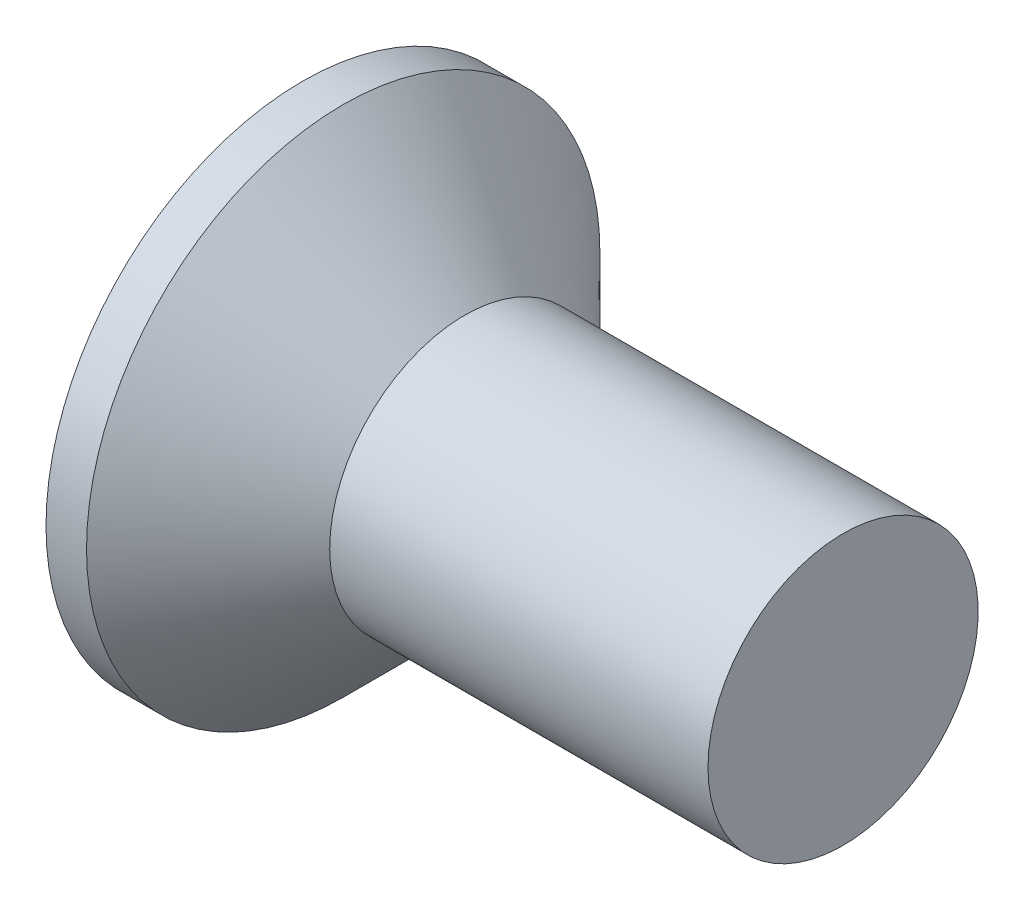
ISO-10303-21;
HEADER;
FILE_DESCRIPTION(('STEP AP214'),'2;1');
FILE_NAME('part.step','',(''),(''),'','','');
FILE_SCHEMA(('AUTOMOTIVE_DESIGN { 1 0 10303 214 1 1 1 1 }'));
ENDSEC;
DATA;
#1=APPLICATION_CONTEXT('core data for automotive mechanical design processes');
#2=APPLICATION_PROTOCOL_DEFINITION('international standard','automotive_design',2000,#1);
#3=PRODUCT_CONTEXT('',#1,'mechanical');
#4=PRODUCT('Part','Part','',(#3));
#5=PRODUCT_RELATED_PRODUCT_CATEGORY('part','',(#4));
#6=PRODUCT_DEFINITION_FORMATION('','',#4);
#7=PRODUCT_DEFINITION_CONTEXT('part definition',#1,'design');
#8=PRODUCT_DEFINITION('design','',#6,#7);
#9=PRODUCT_DEFINITION_SHAPE('','',#8);
#10=(LENGTH_UNIT() NAMED_UNIT(*) SI_UNIT(.MILLI.,.METRE.));
#11=(NAMED_UNIT(*) PLANE_ANGLE_UNIT() SI_UNIT($,.RADIAN.));
#12=(NAMED_UNIT(*) SI_UNIT($,.STERADIAN.) SOLID_ANGLE_UNIT());
#13=UNCERTAINTY_MEASURE_WITH_UNIT(LENGTH_MEASURE(1.E-05),#10,'distance_accuracy_value','');
#14=(GEOMETRIC_REPRESENTATION_CONTEXT(3) GLOBAL_UNCERTAINTY_ASSIGNED_CONTEXT((#13)) GLOBAL_UNIT_ASSIGNED_CONTEXT((#10,
#11,#12)) REPRESENTATION_CONTEXT('',''));
#15=CARTESIAN_POINT('',(0.,0.,0.));
#16=DIRECTION('',(0.,0.,1.));
#17=DIRECTION('',(1.,0.,0.));
#18=AXIS2_PLACEMENT_3D('',#15,#16,#17);
#19=CARTESIAN_POINT('',(0.,0.,0.));
#20=DIRECTION('',(-1.,0.,0.));
#21=DIRECTION('',(0.,0.,1.));
#22=AXIS2_PLACEMENT_3D('',#19,#20,#21);
#23=PLANE('',#22);
#24=CARTESIAN_POINT('',(0.,0.,0.));
#25=DIRECTION('',(-1.,0.,0.));
#26=DIRECTION('',(0.,0.,1.));
#27=AXIS2_PLACEMENT_3D('',#24,#25,#26);
#28=CIRCLE('',#27,1.9);
#29=CARTESIAN_POINT('',(0.,0.,1.9));
#30=VERTEX_POINT('',#29);
#31=EDGE_CURVE('E42',#30,#30,#28,.T.);
#32=ORIENTED_EDGE('',*,*,#31,.T.);
#33=EDGE_LOOP('',(#32));
#34=FACE_BOUND('',#33,.T.);
#35=DIRECTION('',(0.,1.,0.));
#36=VECTOR('',#35,1.);
#37=CARTESIAN_POINT('',(0.,-1.07,-0.264999999999999));
#38=LINE('',#37,#36);
#39=CARTESIAN_POINT('',(0.,-1.07,-0.264999999999999));
#40=VERTEX_POINT('',#39);
#41=CARTESIAN_POINT('',(0.,-0.264999999999999,-0.265));
#42=VERTEX_POINT('',#41);
#43=EDGE_CURVE('E103',#40,#42,#38,.T.);
#44=ORIENTED_EDGE('',*,*,#43,.T.);
#45=DIRECTION('',(0.,0.,-1.));
#46=VECTOR('',#45,1.);
#47=CARTESIAN_POINT('',(0.,-0.265000000000004,1.07));
#48=LINE('',#47,#46);
#49=CARTESIAN_POINT('',(0.,-0.264999999999996,-1.07));
#50=VERTEX_POINT('',#49);
#51=EDGE_CURVE('E83',#42,#50,#48,.T.);
#52=ORIENTED_EDGE('',*,*,#51,.T.);
#53=DIRECTION('',(0.,1.,0.));
#54=VECTOR('',#53,1.);
#55=CARTESIAN_POINT('',(0.,-0.264999999999996,-1.07));
#56=LINE('',#55,#54);
#57=CARTESIAN_POINT('',(0.,0.265000000000003,-1.07));
#58=VERTEX_POINT('',#57);
#59=EDGE_CURVE('E340',#50,#58,#56,.T.);
#60=ORIENTED_EDGE('',*,*,#59,.T.);
#61=DIRECTION('',(0.,0.,1.));
#62=VECTOR('',#61,1.);
#63=CARTESIAN_POINT('',(0.,0.265000000000003,-1.07));
#64=LINE('',#63,#62);
#65=CARTESIAN_POINT('',(0.,0.265,-0.264999999999999));
#66=VERTEX_POINT('',#65);
#67=EDGE_CURVE('E99',#58,#66,#64,.T.);
#68=ORIENTED_EDGE('',*,*,#67,.T.);
#69=CARTESIAN_POINT('',(0.,1.07,-0.265));
#70=VERTEX_POINT('',#69);
#71=EDGE_CURVE('E93',#66,#70,#38,.T.);
#72=ORIENTED_EDGE('',*,*,#71,.T.);
#73=DIRECTION('',(0.,0.,1.));
#74=VECTOR('',#73,1.);
#75=CARTESIAN_POINT('',(0.,1.07,-0.265));
#76=LINE('',#75,#74);
#77=CARTESIAN_POINT('',(0.,1.07,0.265));
#78=VERTEX_POINT('',#77);
#79=EDGE_CURVE('E96',#70,#78,#76,.T.);
#80=ORIENTED_EDGE('',*,*,#79,.T.);
#81=DIRECTION('',(0.,-1.,0.));
#82=VECTOR('',#81,1.);
#83=CARTESIAN_POINT('',(0.,1.07,0.265));
#84=LINE('',#83,#82);
#85=CARTESIAN_POINT('',(0.,0.264999999999999,0.265));
#86=VERTEX_POINT('',#85);
#87=EDGE_CURVE('E352',#78,#86,#84,.T.);
#88=ORIENTED_EDGE('',*,*,#87,.T.);
#89=CARTESIAN_POINT('',(0.,0.264999999999996,1.07));
#90=VERTEX_POINT('',#89);
#91=EDGE_CURVE('E335',#86,#90,#64,.T.);
#92=ORIENTED_EDGE('',*,*,#91,.T.);
#93=DIRECTION('',(0.,-1.,0.));
#94=VECTOR('',#93,1.);
#95=CARTESIAN_POINT('',(0.,0.264999999999996,1.07));
#96=LINE('',#95,#94);
#97=CARTESIAN_POINT('',(0.,-0.265000000000004,1.07));
#98=VERTEX_POINT('',#97);
#99=EDGE_CURVE('E321',#90,#98,#96,.T.);
#100=ORIENTED_EDGE('',*,*,#99,.T.);
#101=CARTESIAN_POINT('',(0.,-0.265000000000001,0.265));
#102=VERTEX_POINT('',#101);
#103=EDGE_CURVE('E333',#98,#102,#48,.T.);
#104=ORIENTED_EDGE('',*,*,#103,.T.);
#105=CARTESIAN_POINT('',(0.,-1.07,0.265));
#106=VERTEX_POINT('',#105);
#107=EDGE_CURVE('E109',#102,#106,#84,.T.);
#108=ORIENTED_EDGE('',*,*,#107,.T.);
#109=DIRECTION('',(0.,0.,-1.));
#110=VECTOR('',#109,1.);
#111=CARTESIAN_POINT('',(0.,-1.07,0.265));
#112=LINE('',#111,#110);
#113=EDGE_CURVE('E132',#106,#40,#112,.T.);
#114=ORIENTED_EDGE('',*,*,#113,.T.);
#115=EDGE_LOOP('',(#44,#52,#60,#68,#72,#80,#88,#92,#100,#104,#108,#114));
#116=FACE_BOUND('',#115,.T.);
#117=ADVANCED_FACE('F35',(#34,#116),#23,.T.);
#118=CARTESIAN_POINT('',(1.75765333333333,0.,0.113773333333333));
#119=DIRECTION('',(-0.0857222578731989,0.,-0.996319072639443));
#120=DIRECTION('',(-0.996319072639444,0.,0.0857222578731989));
#121=AXIS2_PLACEMENT_3D('',#118,#119,#120);
#122=PLANE('',#121);
#123=ORIENTED_EDGE('',*,*,#107,.F.);
#124=DIRECTION('',(0.992678495991953,0.0854090264408664,-0.0854090264408661));
#125=VECTOR('',#124,1.);
#126=CARTESIAN_POINT('',(1.76729945793969,-0.112943390794151,0.11294339079415));
#127=LINE('',#126,#125);
#128=CARTESIAN_POINT('',(1.54,-0.1325,0.1325));
#129=VERTEX_POINT('',#128);
#130=EDGE_CURVE('E127',#102,#129,#127,.T.);
#131=ORIENTED_EDGE('',*,*,#130,.T.);
#132=DIRECTION('',(0.851874354386278,0.518592342361776,-0.0732943843871311));
#133=VECTOR('',#132,1.);
#134=CARTESIAN_POINT('',(0.,-1.07,0.265));
#135=LINE('',#134,#133);
#136=EDGE_CURVE('E104',#106,#129,#135,.T.);
#137=ORIENTED_EDGE('',*,*,#136,.F.);
#138=EDGE_LOOP('',(#123,#131,#137));
#139=FACE_BOUND('',#138,.T.);
#140=ADVANCED_FACE('F155',(#139),#122,.T.);
#141=DIRECTION('',(0.851874354386278,-0.518592342361776,-0.073294384387131));
#142=VECTOR('',#141,1.);
#143=CARTESIAN_POINT('',(0.,1.07,0.265));
#144=LINE('',#143,#142);
#145=CARTESIAN_POINT('',(1.54,0.1325,0.1325));
#146=VERTEX_POINT('',#145);
#147=EDGE_CURVE('E49',#78,#146,#144,.T.);
#148=ORIENTED_EDGE('',*,*,#147,.T.);
#149=DIRECTION('',(-0.992678495991953,0.0854090264408655,0.0854090264408661));
#150=VECTOR('',#149,1.);
#151=CARTESIAN_POINT('',(1.76729945793969,0.11294339079415,0.11294339079415));
#152=LINE('',#151,#150);
#153=EDGE_CURVE('E348',#146,#86,#152,.T.);
#154=ORIENTED_EDGE('',*,*,#153,.T.);
#155=ORIENTED_EDGE('',*,*,#87,.F.);
#156=EDGE_LOOP('',(#148,#154,#155));
#157=FACE_BOUND('',#156,.T.);
#158=ADVANCED_FACE('F159',(#157),#122,.T.);
#159=CARTESIAN_POINT('',(1.75765333333333,0.,-0.113773333333333));
#160=DIRECTION('',(-0.0857222578731985,0.,0.996319072639443));
#161=DIRECTION('',(0.996319072639444,0.,0.0857222578731985));
#162=AXIS2_PLACEMENT_3D('',#159,#160,#161);
#163=PLANE('',#162);
#164=DIRECTION('',(0.851874354386278,0.518592342361776,0.0732943843871307));
#165=VECTOR('',#164,1.);
#166=CARTESIAN_POINT('',(0.,-1.07,-0.264999999999999));
#167=LINE('',#166,#165);
#168=CARTESIAN_POINT('',(1.54,-0.1325,-0.1325));
#169=VERTEX_POINT('',#168);
#170=EDGE_CURVE('E58',#40,#169,#167,.T.);
#171=ORIENTED_EDGE('',*,*,#170,.T.);
#172=DIRECTION('',(-0.992678495991953,-0.0854090264408658,-0.0854090264408657));
#173=VECTOR('',#172,1.);
#174=CARTESIAN_POINT('',(1.76729945793969,-0.11294339079415,-0.112943390794151));
#175=LINE('',#174,#173);
#176=EDGE_CURVE('E11',#169,#42,#175,.T.);
#177=ORIENTED_EDGE('',*,*,#176,.T.);
#178=ORIENTED_EDGE('',*,*,#43,.F.);
#179=EDGE_LOOP('',(#171,#177,#178));
#180=FACE_BOUND('',#179,.T.);
#181=ADVANCED_FACE('F152',(#180),#163,.T.);
#182=ORIENTED_EDGE('',*,*,#71,.F.);
#183=DIRECTION('',(0.992678495991953,-0.0854090264408661,0.0854090264408658));
#184=VECTOR('',#183,1.);
#185=CARTESIAN_POINT('',(1.76729945793969,0.112943390794151,-0.112943390794151));
#186=LINE('',#185,#184);
#187=CARTESIAN_POINT('',(1.54,0.1325,-0.1325));
#188=VERTEX_POINT('',#187);
#189=EDGE_CURVE('E112',#66,#188,#186,.T.);
#190=ORIENTED_EDGE('',*,*,#189,.T.);
#191=DIRECTION('',(0.851874354386278,-0.518592342361776,0.0732943843871308));
#192=VECTOR('',#191,1.);
#193=CARTESIAN_POINT('',(0.,1.07,-0.265));
#194=LINE('',#193,#192);
#195=EDGE_CURVE('E108',#70,#188,#194,.T.);
#196=ORIENTED_EDGE('',*,*,#195,.F.);
#197=EDGE_LOOP('',(#182,#190,#196));
#198=FACE_BOUND('',#197,.T.);
#199=ADVANCED_FACE('F111',(#198),#163,.T.);
#200=CARTESIAN_POINT('',(-6.34999999999999,0.,0.));
#201=DIRECTION('',(-1.,0.,0.));
#202=DIRECTION('',(0.,0.,1.));
#203=AXIS2_PLACEMENT_3D('',#200,#201,#202);
#204=CYLINDRICAL_SURFACE('',#203,1.9);
#205=CARTESIAN_POINT('',(0.300000000000003,0.,0.));
#206=DIRECTION('',(-1.,0.,0.));
#207=DIRECTION('',(0.,0.,1.));
#208=AXIS2_PLACEMENT_3D('',#205,#206,#207);
#209=CIRCLE('',#208,1.9);
#210=CARTESIAN_POINT('',(0.300000000000003,0.,1.9));
#211=VERTEX_POINT('',#210);
#212=EDGE_CURVE('E135',#211,#211,#209,.T.);
#213=ORIENTED_EDGE('',*,*,#212,.T.);
#214=EDGE_LOOP('',(#213));
#215=FACE_BOUND('',#214,.T.);
#216=ORIENTED_EDGE('',*,*,#31,.F.);
#217=EDGE_LOOP('',(#216));
#218=FACE_BOUND('',#217,.T.);
#219=ADVANCED_FACE('F141',(#215,#218),#204,.T.);
#220=CARTESIAN_POINT('',(0.300000000000003,0.,0.));
#221=DIRECTION('',(-1.,0.,0.));
#222=DIRECTION('',(0.,0.,1.));
#223=AXIS2_PLACEMENT_3D('',#220,#221,#222);
#224=CONICAL_SURFACE('',#223,1.9,0.78539816339745);
#225=CARTESIAN_POINT('',(1.2,0.,0.));
#226=DIRECTION('',(-1.,0.,0.));
#227=DIRECTION('',(0.,0.,1.));
#228=AXIS2_PLACEMENT_3D('',#225,#226,#227);
#229=CIRCLE('',#228,1.);
#230=CARTESIAN_POINT('',(1.2,0.,1.));
#231=VERTEX_POINT('',#230);
#232=EDGE_CURVE('E131',#231,#231,#229,.T.);
#233=ORIENTED_EDGE('',*,*,#232,.T.);
#234=EDGE_LOOP('',(#233));
#235=FACE_BOUND('',#234,.T.);
#236=ORIENTED_EDGE('',*,*,#212,.F.);
#237=EDGE_LOOP('',(#236));
#238=FACE_BOUND('',#237,.T.);
#239=ADVANCED_FACE('F143',(#235,#238),#224,.T.);
#240=CARTESIAN_POINT('',(-6.34999999999999,0.,0.));
#241=DIRECTION('',(-1.,0.,0.));
#242=DIRECTION('',(0.,0.,1.));
#243=AXIS2_PLACEMENT_3D('',#240,#241,#242);
#244=CYLINDRICAL_SURFACE('',#243,1.);
#245=CARTESIAN_POINT('',(4.,0.,0.));
#246=DIRECTION('',(-1.,0.,0.));
#247=DIRECTION('',(0.,0.,1.));
#248=AXIS2_PLACEMENT_3D('',#245,#246,#247);
#249=CIRCLE('',#248,1.);
#250=CARTESIAN_POINT('',(4.,0.,1.));
#251=VERTEX_POINT('',#250);
#252=EDGE_CURVE('E128',#251,#251,#249,.T.);
#253=ORIENTED_EDGE('',*,*,#252,.T.);
#254=EDGE_LOOP('',(#253));
#255=FACE_BOUND('',#254,.T.);
#256=ORIENTED_EDGE('',*,*,#232,.F.);
#257=EDGE_LOOP('',(#256));
#258=FACE_BOUND('',#257,.T.);
#259=ADVANCED_FACE('F149',(#255,#258),#244,.T.);
#260=CARTESIAN_POINT('',(4.,1.,0.));
#261=DIRECTION('',(1.,0.,0.));
#262=DIRECTION('',(0.,0.,-1.));
#263=AXIS2_PLACEMENT_3D('',#260,#261,#262);
#264=PLANE('',#263);
#265=ORIENTED_EDGE('',*,*,#252,.F.);
#266=EDGE_LOOP('',(#265));
#267=FACE_BOUND('',#266,.T.);
#268=ADVANCED_FACE('F179',(#267),#264,.T.);
#269=CARTESIAN_POINT('',(1.54,0.1325,-0.1325));
#270=DIRECTION('',(1.,0.,0.));
#271=DIRECTION('',(0.,0.,-1.));
#272=AXIS2_PLACEMENT_3D('',#269,#270,#271);
#273=PLANE('',#272);
#274=DIRECTION('',(0.,1.,0.));
#275=VECTOR('',#274,1.);
#276=CARTESIAN_POINT('',(1.54,-0.1325,-0.1325));
#277=LINE('',#276,#275);
#278=EDGE_CURVE('E123',#169,#188,#277,.T.);
#279=ORIENTED_EDGE('',*,*,#278,.F.);
#280=DIRECTION('',(0.,0.,-1.));
#281=VECTOR('',#280,1.);
#282=CARTESIAN_POINT('',(1.54,-0.1325,0.1325));
#283=LINE('',#282,#281);
#284=EDGE_CURVE('E114',#129,#169,#283,.T.);
#285=ORIENTED_EDGE('',*,*,#284,.F.);
#286=DIRECTION('',(0.,-1.,0.));
#287=VECTOR('',#286,1.);
#288=CARTESIAN_POINT('',(1.54,0.1325,0.1325));
#289=LINE('',#288,#287);
#290=EDGE_CURVE('E117',#146,#129,#289,.T.);
#291=ORIENTED_EDGE('',*,*,#290,.F.);
#292=DIRECTION('',(0.,0.,1.));
#293=VECTOR('',#292,1.);
#294=CARTESIAN_POINT('',(1.54,0.1325,-0.1325));
#295=LINE('',#294,#293);
#296=EDGE_CURVE('E121',#188,#146,#295,.T.);
#297=ORIENTED_EDGE('',*,*,#296,.F.);
#298=EDGE_LOOP('',(#279,#285,#291,#297));
#299=FACE_BOUND('',#298,.T.);
#300=ADVANCED_FACE('F176',(#299),#273,.F.);
#301=CARTESIAN_POINT('',(1.54,-0.1325,-0.1325));
#302=DIRECTION('',(-0.519990936244092,0.854171777936963,0.));
#303=DIRECTION('',(-0.854171777936963,-0.519990936244092,0.));
#304=AXIS2_PLACEMENT_3D('',#301,#302,#303);
#305=PLANE('',#304);
#306=ORIENTED_EDGE('',*,*,#170,.F.);
#307=ORIENTED_EDGE('',*,*,#113,.F.);
#308=ORIENTED_EDGE('',*,*,#136,.T.);
#309=ORIENTED_EDGE('',*,*,#284,.T.);
#310=EDGE_LOOP('',(#306,#307,#308,#309));
#311=FACE_BOUND('',#310,.T.);
#312=ADVANCED_FACE('F168',(#311),#305,.T.);
#313=CARTESIAN_POINT('',(1.54,0.1325,0.1325));
#314=DIRECTION('',(-0.519990936244092,-0.854171777936963,0.));
#315=DIRECTION('',(0.854171777936963,-0.519990936244092,0.));
#316=AXIS2_PLACEMENT_3D('',#313,#314,#315);
#317=PLANE('',#316);
#318=ORIENTED_EDGE('',*,*,#147,.F.);
#319=ORIENTED_EDGE('',*,*,#79,.F.);
#320=ORIENTED_EDGE('',*,*,#195,.T.);
#321=ORIENTED_EDGE('',*,*,#296,.T.);
#322=EDGE_LOOP('',(#318,#319,#320,#321));
#323=FACE_BOUND('',#322,.T.);
#324=ADVANCED_FACE('F107',(#323),#317,.T.);
#325=CARTESIAN_POINT('',(1.75765333333333,-0.113773333333333,0.));
#326=DIRECTION('',(-0.0857222578731989,0.996319072639443,0.));
#327=DIRECTION('',(-0.996319072639444,-0.0857222578731989,0.));
#328=AXIS2_PLACEMENT_3D('',#325,#326,#327);
#329=PLANE('',#328);
#330=DIRECTION('',(0.851874354386278,0.0732943843871293,0.518592342361776));
#331=VECTOR('',#330,1.);
#332=CARTESIAN_POINT('',(0.,-0.264999999999996,-1.07));
#333=LINE('',#332,#331);
#334=EDGE_CURVE('E342',#50,#169,#333,.T.);
#335=ORIENTED_EDGE('',*,*,#334,.F.);
#336=ORIENTED_EDGE('',*,*,#51,.F.);
#337=ORIENTED_EDGE('',*,*,#176,.F.);
#338=EDGE_LOOP('',(#335,#336,#337));
#339=FACE_BOUND('',#338,.T.);
#340=ADVANCED_FACE('F175',(#339),#329,.T.);
#341=CARTESIAN_POINT('',(1.75765333333333,0.113773333333333,0.));
#342=DIRECTION('',(-0.0857222578731985,-0.996319072639443,0.));
#343=DIRECTION('',(0.996319072639444,-0.0857222578731985,0.));
#344=AXIS2_PLACEMENT_3D('',#341,#342,#343);
#345=PLANE('',#344);
#346=ORIENTED_EDGE('',*,*,#67,.F.);
#347=DIRECTION('',(0.851874354386278,-0.0732943843871325,0.518592342361776));
#348=VECTOR('',#347,1.);
#349=CARTESIAN_POINT('',(0.,0.265000000000003,-1.07));
#350=LINE('',#349,#348);
#351=EDGE_CURVE('E74',#58,#188,#350,.T.);
#352=ORIENTED_EDGE('',*,*,#351,.T.);
#353=ORIENTED_EDGE('',*,*,#189,.F.);
#354=EDGE_LOOP('',(#346,#352,#353));
#355=FACE_BOUND('',#354,.T.);
#356=ADVANCED_FACE('F219',(#355),#345,.T.);
#357=CARTESIAN_POINT('',(1.54,0.132500000000001,-0.1325));
#358=DIRECTION('',(-0.519990936244092,0.,0.854171777936963));
#359=DIRECTION('',(-0.854171777936963,0.,-0.519990936244092));
#360=AXIS2_PLACEMENT_3D('',#357,#358,#359);
#361=PLANE('',#360);
#362=ORIENTED_EDGE('',*,*,#351,.F.);
#363=ORIENTED_EDGE('',*,*,#59,.F.);
#364=ORIENTED_EDGE('',*,*,#334,.T.);
#365=ORIENTED_EDGE('',*,*,#278,.T.);
#366=EDGE_LOOP('',(#362,#363,#364,#365));
#367=FACE_BOUND('',#366,.T.);
#368=ADVANCED_FACE('F227',(#367),#361,.T.);
#369=ORIENTED_EDGE('',*,*,#103,.F.);
#370=DIRECTION('',(0.851874354386278,0.0732943843871328,-0.518592342361776));
#371=VECTOR('',#370,1.);
#372=CARTESIAN_POINT('',(0.,-0.265000000000004,1.07));
#373=LINE('',#372,#371);
#374=EDGE_CURVE('E318',#98,#129,#373,.T.);
#375=ORIENTED_EDGE('',*,*,#374,.T.);
#376=ORIENTED_EDGE('',*,*,#130,.F.);
#377=EDGE_LOOP('',(#369,#375,#376));
#378=FACE_BOUND('',#377,.T.);
#379=ADVANCED_FACE('F221',(#378),#329,.T.);
#380=DIRECTION('',(0.851874354386278,-0.073294384387129,-0.518592342361776));
#381=VECTOR('',#380,1.);
#382=CARTESIAN_POINT('',(0.,0.264999999999996,1.07));
#383=LINE('',#382,#381);
#384=EDGE_CURVE('E329',#90,#146,#383,.T.);
#385=ORIENTED_EDGE('',*,*,#384,.F.);
#386=ORIENTED_EDGE('',*,*,#91,.F.);
#387=ORIENTED_EDGE('',*,*,#153,.F.);
#388=EDGE_LOOP('',(#385,#386,#387));
#389=FACE_BOUND('',#388,.T.);
#390=ADVANCED_FACE('F229',(#389),#345,.T.);
#391=CARTESIAN_POINT('',(1.54,-0.1325,0.1325));
#392=DIRECTION('',(-0.519990936244092,0.,-0.854171777936963));
#393=DIRECTION('',(0.854171777936963,0.,-0.519990936244092));
#394=AXIS2_PLACEMENT_3D('',#391,#392,#393);
#395=PLANE('',#394);
#396=ORIENTED_EDGE('',*,*,#374,.F.);
#397=ORIENTED_EDGE('',*,*,#99,.F.);
#398=ORIENTED_EDGE('',*,*,#384,.T.);
#399=ORIENTED_EDGE('',*,*,#290,.T.);
#400=EDGE_LOOP('',(#396,#397,#398,#399));
#401=FACE_BOUND('',#400,.T.);
#402=ADVANCED_FACE('F248',(#401),#395,.T.);
#403=CLOSED_SHELL('',(#117,#140,#158,#181,#199,#219,#239,#259,#268,#300,#312,#324,#340,#356,
#368,#379,#390,#402));
#404=MANIFOLD_SOLID_BREP('B2',#403);
#405=ADVANCED_BREP_SHAPE_REPRESENTATION('',(#18,#404),#14);
#406=SHAPE_DEFINITION_REPRESENTATION(#9,#405);
ENDSEC;
END-ISO-10303-21;
